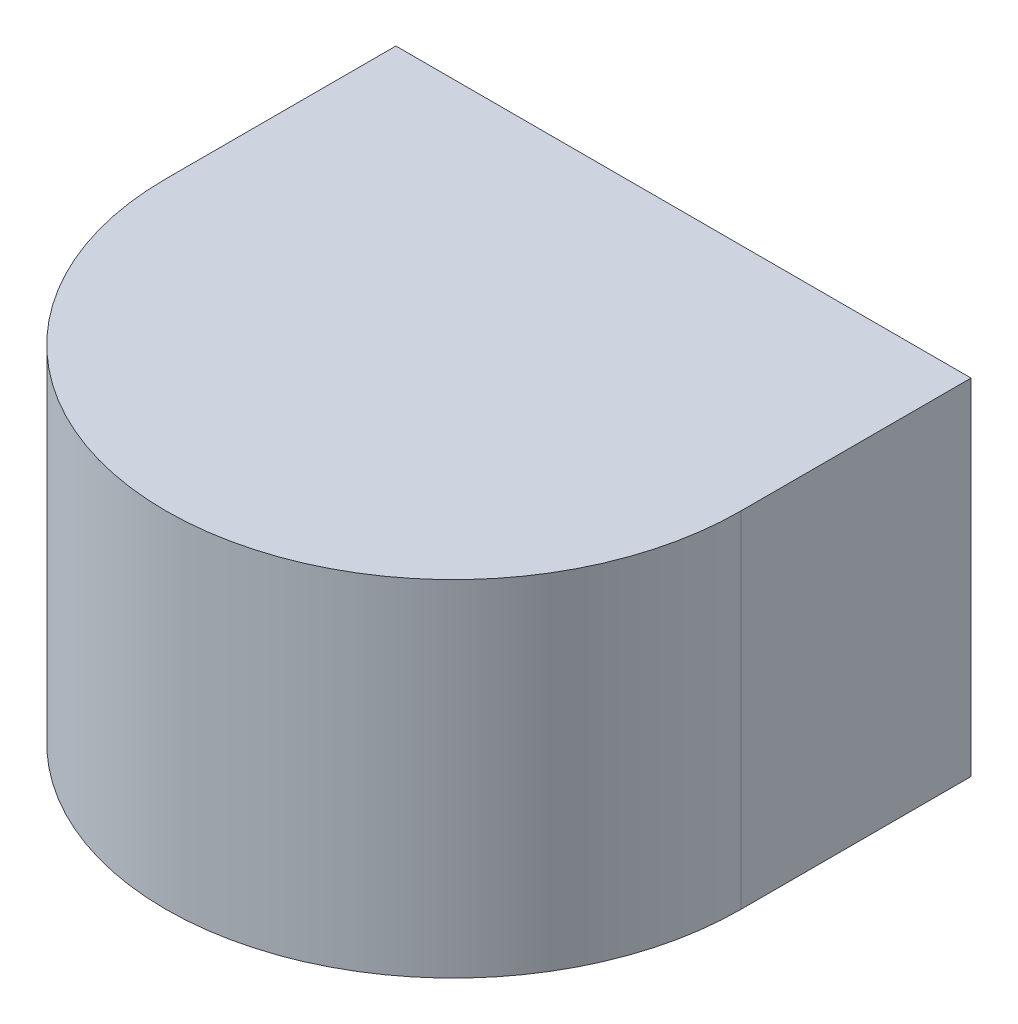
ISO-10303-21;
HEADER;
FILE_DESCRIPTION(('STEP AP214'),'2;1');
FILE_NAME('part.step','',(''),(''),'','','');
FILE_SCHEMA(('AUTOMOTIVE_DESIGN { 1 0 10303 214 1 1 1 1 }'));
ENDSEC;
DATA;
#1=APPLICATION_CONTEXT('core data for automotive mechanical design processes');
#2=APPLICATION_PROTOCOL_DEFINITION('international standard','automotive_design',2000,#1);
#3=PRODUCT_CONTEXT('',#1,'mechanical');
#4=PRODUCT('Part','Part','',(#3));
#5=PRODUCT_RELATED_PRODUCT_CATEGORY('part','',(#4));
#6=PRODUCT_DEFINITION_FORMATION('','',#4);
#7=PRODUCT_DEFINITION_CONTEXT('part definition',#1,'design');
#8=PRODUCT_DEFINITION('design','',#6,#7);
#9=PRODUCT_DEFINITION_SHAPE('','',#8);
#10=(LENGTH_UNIT() NAMED_UNIT(*) SI_UNIT(.MILLI.,.METRE.));
#11=(NAMED_UNIT(*) PLANE_ANGLE_UNIT() SI_UNIT($,.RADIAN.));
#12=(NAMED_UNIT(*) SI_UNIT($,.STERADIAN.) SOLID_ANGLE_UNIT());
#13=UNCERTAINTY_MEASURE_WITH_UNIT(LENGTH_MEASURE(1.E-05),#10,'distance_accuracy_value','');
#14=(GEOMETRIC_REPRESENTATION_CONTEXT(3) GLOBAL_UNCERTAINTY_ASSIGNED_CONTEXT((#13)) GLOBAL_UNIT_ASSIGNED_CONTEXT((#10,
#11,#12)) REPRESENTATION_CONTEXT('',''));
#15=CARTESIAN_POINT('',(0.,0.,0.));
#16=DIRECTION('',(0.,0.,1.));
#17=DIRECTION('',(1.,0.,0.));
#18=AXIS2_PLACEMENT_3D('',#15,#16,#17);
#19=CARTESIAN_POINT('',(0.,100.,0.));
#20=DIRECTION('',(0.,-1.,0.));
#21=DIRECTION('',(0.,0.,-1.));
#22=AXIS2_PLACEMENT_3D('',#19,#20,#21);
#23=CYLINDRICAL_SURFACE('',#22,125.);
#24=CARTESIAN_POINT('',(0.,0.,0.));
#25=DIRECTION('',(0.,1.,0.));
#26=DIRECTION('',(0.,0.,-1.));
#27=AXIS2_PLACEMENT_3D('',#24,#25,#26);
#28=CIRCLE('',#27,125.);
#29=CARTESIAN_POINT('',(-125.,0.,0.));
#30=VERTEX_POINT('',#29);
#31=CARTESIAN_POINT('',(125.,0.,0.));
#32=VERTEX_POINT('',#31);
#33=EDGE_CURVE('E230',#30,#32,#28,.T.);
#34=ORIENTED_EDGE('',*,*,#33,.T.);
#35=DIRECTION('',(0.,-1.,0.));
#36=VECTOR('',#35,1.);
#37=CARTESIAN_POINT('',(125.,100.,0.));
#38=LINE('',#37,#36);
#39=CARTESIAN_POINT('',(125.,150.,0.));
#40=VERTEX_POINT('',#39);
#41=EDGE_CURVE('E11',#40,#32,#38,.T.);
#42=ORIENTED_EDGE('',*,*,#41,.F.);
#43=CARTESIAN_POINT('',(0.,150.,0.));
#44=DIRECTION('',(0.,1.,0.));
#45=DIRECTION('',(0.,0.,1.));
#46=AXIS2_PLACEMENT_3D('',#43,#44,#45);
#47=CIRCLE('',#46,125.);
#48=CARTESIAN_POINT('',(-125.,150.,0.));
#49=VERTEX_POINT('',#48);
#50=EDGE_CURVE('E218',#49,#40,#47,.T.);
#51=ORIENTED_EDGE('',*,*,#50,.F.);
#52=DIRECTION('',(0.,-1.,0.));
#53=VECTOR('',#52,1.);
#54=CARTESIAN_POINT('',(-125.,100.,0.));
#55=LINE('',#54,#53);
#56=EDGE_CURVE('E247',#49,#30,#55,.T.);
#57=ORIENTED_EDGE('',*,*,#56,.T.);
#58=EDGE_LOOP('',(#34,#42,#51,#57));
#59=FACE_BOUND('',#58,.T.);
#60=ADVANCED_FACE('F35',(#59),#23,.T.);
#61=CARTESIAN_POINT('',(125.,100.,0.));
#62=DIRECTION('',(-1.,0.,0.));
#63=DIRECTION('',(0.,0.,1.));
#64=AXIS2_PLACEMENT_3D('',#61,#62,#63);
#65=PLANE('',#64);
#66=DIRECTION('',(0.,0.,-1.));
#67=VECTOR('',#66,1.);
#68=CARTESIAN_POINT('',(125.,0.,0.));
#69=LINE('',#68,#67);
#70=CARTESIAN_POINT('',(125.,0.,-100.));
#71=VERTEX_POINT('',#70);
#72=EDGE_CURVE('E293',#32,#71,#69,.T.);
#73=ORIENTED_EDGE('',*,*,#72,.T.);
#74=DIRECTION('',(0.,-1.,0.));
#75=VECTOR('',#74,1.);
#76=CARTESIAN_POINT('',(125.,100.,-100.));
#77=LINE('',#76,#75);
#78=CARTESIAN_POINT('',(125.,150.,-100.));
#79=VERTEX_POINT('',#78);
#80=EDGE_CURVE('E43',#79,#71,#77,.T.);
#81=ORIENTED_EDGE('',*,*,#80,.F.);
#82=DIRECTION('',(0.,0.,-1.));
#83=VECTOR('',#82,1.);
#84=CARTESIAN_POINT('',(125.,150.,0.));
#85=LINE('',#84,#83);
#86=EDGE_CURVE('E221',#40,#79,#85,.T.);
#87=ORIENTED_EDGE('',*,*,#86,.F.);
#88=ORIENTED_EDGE('',*,*,#41,.T.);
#89=EDGE_LOOP('',(#73,#81,#87,#88));
#90=FACE_BOUND('',#89,.T.);
#91=ADVANCED_FACE('F311',(#90),#65,.F.);
#92=CARTESIAN_POINT('',(100.,100.,-100.));
#93=DIRECTION('',(1.,0.,0.));
#94=DIRECTION('',(0.,0.,-1.));
#95=AXIS2_PLACEMENT_3D('',#92,#93,#94);
#96=PLANE('',#95);
#97=DIRECTION('',(0.,0.,1.));
#98=VECTOR('',#97,1.);
#99=CARTESIAN_POINT('',(100.,0.,-100.));
#100=LINE('',#99,#98);
#101=CARTESIAN_POINT('',(100.,0.,-100.));
#102=VERTEX_POINT('',#101);
#103=CARTESIAN_POINT('',(100.,0.,-70.));
#104=VERTEX_POINT('',#103);
#105=EDGE_CURVE('E297',#102,#104,#100,.T.);
#106=ORIENTED_EDGE('',*,*,#105,.T.);
#107=DIRECTION('',(0.,-1.,0.));
#108=VECTOR('',#107,1.);
#109=CARTESIAN_POINT('',(100.,100.,-70.));
#110=LINE('',#109,#108);
#111=CARTESIAN_POINT('',(100.,100.,-70.));
#112=VERTEX_POINT('',#111);
#113=EDGE_CURVE('E253',#112,#104,#110,.T.);
#114=ORIENTED_EDGE('',*,*,#113,.F.);
#115=DIRECTION('',(0.,0.,1.));
#116=VECTOR('',#115,1.);
#117=CARTESIAN_POINT('',(100.,100.,-100.));
#118=LINE('',#117,#116);
#119=CARTESIAN_POINT('',(100.,100.,-100.));
#120=VERTEX_POINT('',#119);
#121=EDGE_CURVE('E239',#120,#112,#118,.T.);
#122=ORIENTED_EDGE('',*,*,#121,.F.);
#123=DIRECTION('',(0.,-1.,0.));
#124=VECTOR('',#123,1.);
#125=CARTESIAN_POINT('',(100.,100.,-100.));
#126=LINE('',#125,#124);
#127=EDGE_CURVE('E250',#120,#102,#126,.T.);
#128=ORIENTED_EDGE('',*,*,#127,.T.);
#129=EDGE_LOOP('',(#106,#114,#122,#128));
#130=FACE_BOUND('',#129,.T.);
#131=ADVANCED_FACE('F308',(#130),#96,.F.);
#132=CARTESIAN_POINT('',(-100.,100.,-70.));
#133=DIRECTION('',(0.,0.,1.));
#134=DIRECTION('',(1.,0.,0.));
#135=AXIS2_PLACEMENT_3D('',#132,#133,#134);
#136=PLANE('',#135);
#137=DIRECTION('',(-1.,0.,0.));
#138=VECTOR('',#137,1.);
#139=CARTESIAN_POINT('',(-100.,0.,-70.));
#140=LINE('',#139,#138);
#141=CARTESIAN_POINT('',(-100.,0.,-70.));
#142=VERTEX_POINT('',#141);
#143=EDGE_CURVE('E301',#104,#142,#140,.T.);
#144=ORIENTED_EDGE('',*,*,#143,.T.);
#145=DIRECTION('',(0.,-1.,0.));
#146=VECTOR('',#145,1.);
#147=CARTESIAN_POINT('',(-100.,100.,-70.));
#148=LINE('',#147,#146);
#149=CARTESIAN_POINT('',(-100.,100.,-70.));
#150=VERTEX_POINT('',#149);
#151=EDGE_CURVE('E274',#150,#142,#148,.T.);
#152=ORIENTED_EDGE('',*,*,#151,.F.);
#153=DIRECTION('',(-1.,0.,0.));
#154=VECTOR('',#153,1.);
#155=CARTESIAN_POINT('',(-100.,100.,-70.));
#156=LINE('',#155,#154);
#157=EDGE_CURVE('E235',#112,#150,#156,.T.);
#158=ORIENTED_EDGE('',*,*,#157,.F.);
#159=ORIENTED_EDGE('',*,*,#113,.T.);
#160=EDGE_LOOP('',(#144,#152,#158,#159));
#161=FACE_BOUND('',#160,.T.);
#162=ADVANCED_FACE('F305',(#161),#136,.F.);
#163=CARTESIAN_POINT('',(-100.,100.,-100.));
#164=DIRECTION('',(-1.,0.,0.));
#165=DIRECTION('',(0.,0.,1.));
#166=AXIS2_PLACEMENT_3D('',#163,#164,#165);
#167=PLANE('',#166);
#168=DIRECTION('',(0.,0.,-1.));
#169=VECTOR('',#168,1.);
#170=CARTESIAN_POINT('',(-100.,0.,-100.));
#171=LINE('',#170,#169);
#172=CARTESIAN_POINT('',(-100.,0.,-100.));
#173=VERTEX_POINT('',#172);
#174=EDGE_CURVE('E266',#142,#173,#171,.T.);
#175=ORIENTED_EDGE('',*,*,#174,.T.);
#176=DIRECTION('',(0.,-1.,0.));
#177=VECTOR('',#176,1.);
#178=CARTESIAN_POINT('',(-100.,100.,-100.));
#179=LINE('',#178,#177);
#180=CARTESIAN_POINT('',(-100.,100.,-100.));
#181=VERTEX_POINT('',#180);
#182=EDGE_CURVE('E273',#181,#173,#179,.T.);
#183=ORIENTED_EDGE('',*,*,#182,.F.);
#184=DIRECTION('',(0.,0.,-1.));
#185=VECTOR('',#184,1.);
#186=CARTESIAN_POINT('',(-100.,100.,-100.));
#187=LINE('',#186,#185);
#188=EDGE_CURVE('E238',#150,#181,#187,.T.);
#189=ORIENTED_EDGE('',*,*,#188,.F.);
#190=ORIENTED_EDGE('',*,*,#151,.T.);
#191=EDGE_LOOP('',(#175,#183,#189,#190));
#192=FACE_BOUND('',#191,.T.);
#193=ADVANCED_FACE('F302',(#192),#167,.F.);
#194=CARTESIAN_POINT('',(-125.,100.,-100.));
#195=DIRECTION('',(0.,0.,1.));
#196=DIRECTION('',(1.,0.,0.));
#197=AXIS2_PLACEMENT_3D('',#194,#195,#196);
#198=PLANE('',#197);
#199=DIRECTION('',(-1.,0.,0.));
#200=VECTOR('',#199,1.);
#201=CARTESIAN_POINT('',(-125.,0.,-100.));
#202=LINE('',#201,#200);
#203=CARTESIAN_POINT('',(-125.,0.,-100.));
#204=VERTEX_POINT('',#203);
#205=EDGE_CURVE('E260',#173,#204,#202,.T.);
#206=ORIENTED_EDGE('',*,*,#205,.T.);
#207=DIRECTION('',(0.,-1.,0.));
#208=VECTOR('',#207,1.);
#209=CARTESIAN_POINT('',(-125.,100.,-100.));
#210=LINE('',#209,#208);
#211=CARTESIAN_POINT('',(-125.,150.,-100.));
#212=VERTEX_POINT('',#211);
#213=EDGE_CURVE('E271',#212,#204,#210,.T.);
#214=ORIENTED_EDGE('',*,*,#213,.F.);
#215=DIRECTION('',(-1.,0.,0.));
#216=VECTOR('',#215,1.);
#217=CARTESIAN_POINT('',(125.,150.,-100.));
#218=LINE('',#217,#216);
#219=EDGE_CURVE('E224',#79,#212,#218,.T.);
#220=ORIENTED_EDGE('',*,*,#219,.F.);
#221=ORIENTED_EDGE('',*,*,#80,.T.);
#222=DIRECTION('',(-1.,0.,0.));
#223=VECTOR('',#222,1.);
#224=CARTESIAN_POINT('',(125.,0.,-100.));
#225=LINE('',#224,#223);
#226=EDGE_CURVE('E295',#71,#102,#225,.T.);
#227=ORIENTED_EDGE('',*,*,#226,.T.);
#228=ORIENTED_EDGE('',*,*,#127,.F.);
#229=DIRECTION('',(-1.,0.,0.));
#230=VECTOR('',#229,1.);
#231=CARTESIAN_POINT('',(-100.,100.,-100.));
#232=LINE('',#231,#230);
#233=EDGE_CURVE('E212',#120,#181,#232,.T.);
#234=ORIENTED_EDGE('',*,*,#233,.T.);
#235=ORIENTED_EDGE('',*,*,#182,.T.);
#236=EDGE_LOOP('',(#206,#214,#220,#221,#227,#228,#234,#235));
#237=FACE_BOUND('',#236,.T.);
#238=ADVANCED_FACE('F283',(#237),#198,.F.);
#239=CARTESIAN_POINT('',(-125.,100.,0.));
#240=DIRECTION('',(1.,0.,0.));
#241=DIRECTION('',(0.,0.,-1.));
#242=AXIS2_PLACEMENT_3D('',#239,#240,#241);
#243=PLANE('',#242);
#244=DIRECTION('',(0.,0.,1.));
#245=VECTOR('',#244,1.);
#246=CARTESIAN_POINT('',(-125.,0.,0.));
#247=LINE('',#246,#245);
#248=EDGE_CURVE('E256',#204,#30,#247,.T.);
#249=ORIENTED_EDGE('',*,*,#248,.T.);
#250=ORIENTED_EDGE('',*,*,#56,.F.);
#251=DIRECTION('',(0.,0.,1.));
#252=VECTOR('',#251,1.);
#253=CARTESIAN_POINT('',(-125.,150.,-100.));
#254=LINE('',#253,#252);
#255=EDGE_CURVE('E227',#212,#49,#254,.T.);
#256=ORIENTED_EDGE('',*,*,#255,.F.);
#257=ORIENTED_EDGE('',*,*,#213,.T.);
#258=EDGE_LOOP('',(#249,#250,#256,#257));
#259=FACE_BOUND('',#258,.T.);
#260=ADVANCED_FACE('F316',(#259),#243,.F.);
#261=CARTESIAN_POINT('',(0.,0.,0.));
#262=DIRECTION('',(0.,-1.,0.));
#263=DIRECTION('',(0.,0.,-1.));
#264=AXIS2_PLACEMENT_3D('',#261,#262,#263);
#265=PLANE('',#264);
#266=DIRECTION('',(0.,0.,1.));
#267=VECTOR('',#266,1.);
#268=CARTESIAN_POINT('',(113.,0.,-22.5));
#269=LINE('',#268,#267);
#270=CARTESIAN_POINT('',(113.,0.,-22.5));
#271=VERTEX_POINT('',#270);
#272=CARTESIAN_POINT('',(113.,0.,22.5));
#273=VERTEX_POINT('',#272);
#274=EDGE_CURVE('E51',#271,#273,#269,.T.);
#275=ORIENTED_EDGE('',*,*,#274,.F.);
#276=DIRECTION('',(1.,0.,0.));
#277=VECTOR('',#276,1.);
#278=CARTESIAN_POINT('',(113.,0.,-22.5));
#279=LINE('',#278,#277);
#280=CARTESIAN_POINT('',(83.,0.,-22.5));
#281=VERTEX_POINT('',#280);
#282=EDGE_CURVE('E169',#281,#271,#279,.T.);
#283=ORIENTED_EDGE('',*,*,#282,.F.);
#284=DIRECTION('',(0.,0.,-1.));
#285=VECTOR('',#284,1.);
#286=CARTESIAN_POINT('',(83.,0.,-22.5));
#287=LINE('',#286,#285);
#288=CARTESIAN_POINT('',(83.,0.,22.5));
#289=VERTEX_POINT('',#288);
#290=EDGE_CURVE('E172',#289,#281,#287,.T.);
#291=ORIENTED_EDGE('',*,*,#290,.F.);
#292=DIRECTION('',(-1.,0.,0.));
#293=VECTOR('',#292,1.);
#294=CARTESIAN_POINT('',(113.,0.,22.5));
#295=LINE('',#294,#293);
#296=EDGE_CURVE('E178',#273,#289,#295,.T.);
#297=ORIENTED_EDGE('',*,*,#296,.F.);
#298=EDGE_LOOP('',(#275,#283,#291,#297));
#299=FACE_BOUND('',#298,.T.);
#300=DIRECTION('',(0.,0.,1.));
#301=VECTOR('',#300,1.);
#302=CARTESIAN_POINT('',(-83.,0.,-22.5));
#303=LINE('',#302,#301);
#304=CARTESIAN_POINT('',(-83.,0.,-22.5));
#305=VERTEX_POINT('',#304);
#306=CARTESIAN_POINT('',(-83.,0.,22.5));
#307=VERTEX_POINT('',#306);
#308=EDGE_CURVE('E59',#305,#307,#303,.T.);
#309=ORIENTED_EDGE('',*,*,#308,.F.);
#310=DIRECTION('',(1.,0.,0.));
#311=VECTOR('',#310,1.);
#312=CARTESIAN_POINT('',(-113.,0.,-22.5));
#313=LINE('',#312,#311);
#314=CARTESIAN_POINT('',(-113.,0.,-22.5));
#315=VERTEX_POINT('',#314);
#316=EDGE_CURVE('E191',#315,#305,#313,.T.);
#317=ORIENTED_EDGE('',*,*,#316,.F.);
#318=DIRECTION('',(0.,0.,-1.));
#319=VECTOR('',#318,1.);
#320=CARTESIAN_POINT('',(-113.,0.,-22.5));
#321=LINE('',#320,#319);
#322=CARTESIAN_POINT('',(-113.,0.,22.5));
#323=VERTEX_POINT('',#322);
#324=EDGE_CURVE('E205',#323,#315,#321,.T.);
#325=ORIENTED_EDGE('',*,*,#324,.F.);
#326=DIRECTION('',(-1.,0.,0.));
#327=VECTOR('',#326,1.);
#328=CARTESIAN_POINT('',(-113.,0.,22.5));
#329=LINE('',#328,#327);
#330=EDGE_CURVE('E202',#307,#323,#329,.T.);
#331=ORIENTED_EDGE('',*,*,#330,.F.);
#332=EDGE_LOOP('',(#309,#317,#325,#331));
#333=FACE_BOUND('',#332,.T.);
#334=ORIENTED_EDGE('',*,*,#33,.F.);
#335=ORIENTED_EDGE('',*,*,#248,.F.);
#336=ORIENTED_EDGE('',*,*,#205,.F.);
#337=ORIENTED_EDGE('',*,*,#174,.F.);
#338=ORIENTED_EDGE('',*,*,#143,.F.);
#339=ORIENTED_EDGE('',*,*,#105,.F.);
#340=ORIENTED_EDGE('',*,*,#226,.F.);
#341=ORIENTED_EDGE('',*,*,#72,.F.);
#342=EDGE_LOOP('',(#334,#335,#336,#337,#338,#339,#340,#341));
#343=FACE_BOUND('',#342,.T.);
#344=ADVANCED_FACE('F289',(#299,#333,#343),#265,.T.);
#345=CARTESIAN_POINT('',(0.,100.,0.));
#346=DIRECTION('',(0.,1.,0.));
#347=DIRECTION('',(0.,0.,1.));
#348=AXIS2_PLACEMENT_3D('',#345,#346,#347);
#349=PLANE('',#348);
#350=ORIENTED_EDGE('',*,*,#233,.F.);
#351=ORIENTED_EDGE('',*,*,#121,.T.);
#352=ORIENTED_EDGE('',*,*,#157,.T.);
#353=ORIENTED_EDGE('',*,*,#188,.T.);
#354=EDGE_LOOP('',(#350,#351,#352,#353));
#355=FACE_BOUND('',#354,.T.);
#356=ADVANCED_FACE('F324',(#355),#349,.F.);
#357=CARTESIAN_POINT('',(0.,150.,0.));
#358=DIRECTION('',(0.,1.,0.));
#359=DIRECTION('',(0.,0.,1.));
#360=AXIS2_PLACEMENT_3D('',#357,#358,#359);
#361=PLANE('',#360);
#362=ORIENTED_EDGE('',*,*,#50,.T.);
#363=ORIENTED_EDGE('',*,*,#86,.T.);
#364=ORIENTED_EDGE('',*,*,#219,.T.);
#365=ORIENTED_EDGE('',*,*,#255,.T.);
#366=EDGE_LOOP('',(#362,#363,#364,#365));
#367=FACE_BOUND('',#366,.T.);
#368=ADVANCED_FACE('F313',(#367),#361,.T.);
#369=CARTESIAN_POINT('',(-83.,20.,-22.5));
#370=DIRECTION('',(1.,0.,0.));
#371=DIRECTION('',(0.,0.,-1.));
#372=AXIS2_PLACEMENT_3D('',#369,#370,#371);
#373=PLANE('',#372);
#374=ORIENTED_EDGE('',*,*,#308,.T.);
#375=DIRECTION('',(0.,-1.,0.));
#376=VECTOR('',#375,1.);
#377=CARTESIAN_POINT('',(-83.,20.,22.5));
#378=LINE('',#377,#376);
#379=CARTESIAN_POINT('',(-83.,20.,22.5));
#380=VERTEX_POINT('',#379);
#381=EDGE_CURVE('E200',#380,#307,#378,.T.);
#382=ORIENTED_EDGE('',*,*,#381,.F.);
#383=DIRECTION('',(0.,0.,1.));
#384=VECTOR('',#383,1.);
#385=CARTESIAN_POINT('',(-83.,20.,-22.5));
#386=LINE('',#385,#384);
#387=CARTESIAN_POINT('',(-83.,20.,-22.5));
#388=VERTEX_POINT('',#387);
#389=EDGE_CURVE('E187',#388,#380,#386,.T.);
#390=ORIENTED_EDGE('',*,*,#389,.F.);
#391=DIRECTION('',(0.,-1.,0.));
#392=VECTOR('',#391,1.);
#393=CARTESIAN_POINT('',(-83.,20.,-22.5));
#394=LINE('',#393,#392);
#395=EDGE_CURVE('E210',#388,#305,#394,.T.);
#396=ORIENTED_EDGE('',*,*,#395,.T.);
#397=EDGE_LOOP('',(#374,#382,#390,#396));
#398=FACE_BOUND('',#397,.T.);
#399=ADVANCED_FACE('F370',(#398),#373,.F.);
#400=CARTESIAN_POINT('',(-113.,20.,-22.5));
#401=DIRECTION('',(0.,0.,-1.));
#402=DIRECTION('',(-1.,0.,0.));
#403=AXIS2_PLACEMENT_3D('',#400,#401,#402);
#404=PLANE('',#403);
#405=ORIENTED_EDGE('',*,*,#316,.T.);
#406=ORIENTED_EDGE('',*,*,#395,.F.);
#407=DIRECTION('',(1.,0.,0.));
#408=VECTOR('',#407,1.);
#409=CARTESIAN_POINT('',(-113.,20.,-22.5));
#410=LINE('',#409,#408);
#411=CARTESIAN_POINT('',(-113.,20.,-22.5));
#412=VERTEX_POINT('',#411);
#413=EDGE_CURVE('E197',#412,#388,#410,.T.);
#414=ORIENTED_EDGE('',*,*,#413,.F.);
#415=DIRECTION('',(0.,-1.,0.));
#416=VECTOR('',#415,1.);
#417=CARTESIAN_POINT('',(-113.,20.,-22.5));
#418=LINE('',#417,#416);
#419=EDGE_CURVE('E213',#412,#315,#418,.T.);
#420=ORIENTED_EDGE('',*,*,#419,.T.);
#421=EDGE_LOOP('',(#405,#406,#414,#420));
#422=FACE_BOUND('',#421,.T.);
#423=ADVANCED_FACE('F383',(#422),#404,.F.);
#424=CARTESIAN_POINT('',(-113.,20.,-22.5));
#425=DIRECTION('',(-1.,0.,0.));
#426=DIRECTION('',(0.,0.,1.));
#427=AXIS2_PLACEMENT_3D('',#424,#425,#426);
#428=PLANE('',#427);
#429=ORIENTED_EDGE('',*,*,#324,.T.);
#430=ORIENTED_EDGE('',*,*,#419,.F.);
#431=DIRECTION('',(0.,0.,-1.));
#432=VECTOR('',#431,1.);
#433=CARTESIAN_POINT('',(-113.,20.,-22.5));
#434=LINE('',#433,#432);
#435=CARTESIAN_POINT('',(-113.,20.,22.5));
#436=VERTEX_POINT('',#435);
#437=EDGE_CURVE('E194',#436,#412,#434,.T.);
#438=ORIENTED_EDGE('',*,*,#437,.F.);
#439=DIRECTION('',(0.,-1.,0.));
#440=VECTOR('',#439,1.);
#441=CARTESIAN_POINT('',(-113.,20.,22.5));
#442=LINE('',#441,#440);
#443=EDGE_CURVE('E215',#436,#323,#442,.T.);
#444=ORIENTED_EDGE('',*,*,#443,.T.);
#445=EDGE_LOOP('',(#429,#430,#438,#444));
#446=FACE_BOUND('',#445,.T.);
#447=ADVANCED_FACE('F392',(#446),#428,.F.);
#448=CARTESIAN_POINT('',(-113.,20.,22.5));
#449=DIRECTION('',(0.,0.,1.));
#450=DIRECTION('',(1.,0.,0.));
#451=AXIS2_PLACEMENT_3D('',#448,#449,#450);
#452=PLANE('',#451);
#453=ORIENTED_EDGE('',*,*,#330,.T.);
#454=ORIENTED_EDGE('',*,*,#443,.F.);
#455=DIRECTION('',(-1.,0.,0.));
#456=VECTOR('',#455,1.);
#457=CARTESIAN_POINT('',(-113.,20.,22.5));
#458=LINE('',#457,#456);
#459=EDGE_CURVE('E190',#380,#436,#458,.T.);
#460=ORIENTED_EDGE('',*,*,#459,.F.);
#461=ORIENTED_EDGE('',*,*,#381,.T.);
#462=EDGE_LOOP('',(#453,#454,#460,#461));
#463=FACE_BOUND('',#462,.T.);
#464=ADVANCED_FACE('F402',(#463),#452,.F.);
#465=CARTESIAN_POINT('',(0.,20.,0.));
#466=DIRECTION('',(0.,1.,0.));
#467=DIRECTION('',(0.,0.,1.));
#468=AXIS2_PLACEMENT_3D('',#465,#466,#467);
#469=PLANE('',#468);
#470=ORIENTED_EDGE('',*,*,#389,.T.);
#471=ORIENTED_EDGE('',*,*,#459,.T.);
#472=ORIENTED_EDGE('',*,*,#437,.T.);
#473=ORIENTED_EDGE('',*,*,#413,.T.);
#474=EDGE_LOOP('',(#470,#471,#472,#473));
#475=FACE_BOUND('',#474,.T.);
#476=ADVANCED_FACE('F412',(#475),#469,.F.);
#477=CARTESIAN_POINT('',(113.,20.,-22.5));
#478=DIRECTION('',(1.,0.,0.));
#479=DIRECTION('',(0.,0.,-1.));
#480=AXIS2_PLACEMENT_3D('',#477,#478,#479);
#481=PLANE('',#480);
#482=ORIENTED_EDGE('',*,*,#274,.T.);
#483=DIRECTION('',(0.,-1.,0.));
#484=VECTOR('',#483,1.);
#485=CARTESIAN_POINT('',(113.,20.,22.5));
#486=LINE('',#485,#484);
#487=CARTESIAN_POINT('',(113.,20.,22.5));
#488=VERTEX_POINT('',#487);
#489=EDGE_CURVE('E147',#488,#273,#486,.T.);
#490=ORIENTED_EDGE('',*,*,#489,.F.);
#491=DIRECTION('',(0.,0.,1.));
#492=VECTOR('',#491,1.);
#493=CARTESIAN_POINT('',(113.,20.,-22.5));
#494=LINE('',#493,#492);
#495=CARTESIAN_POINT('',(113.,20.,-22.5));
#496=VERTEX_POINT('',#495);
#497=EDGE_CURVE('E151',#496,#488,#494,.T.);
#498=ORIENTED_EDGE('',*,*,#497,.F.);
#499=DIRECTION('',(0.,-1.,0.));
#500=VECTOR('',#499,1.);
#501=CARTESIAN_POINT('',(113.,20.,-22.5));
#502=LINE('',#501,#500);
#503=EDGE_CURVE('E182',#496,#271,#502,.T.);
#504=ORIENTED_EDGE('',*,*,#503,.T.);
#505=EDGE_LOOP('',(#482,#490,#498,#504));
#506=FACE_BOUND('',#505,.T.);
#507=ADVANCED_FACE('F149',(#506),#481,.F.);
#508=CARTESIAN_POINT('',(113.,20.,-22.5));
#509=DIRECTION('',(0.,0.,-1.));
#510=DIRECTION('',(-1.,0.,0.));
#511=AXIS2_PLACEMENT_3D('',#508,#509,#510);
#512=PLANE('',#511);
#513=ORIENTED_EDGE('',*,*,#282,.T.);
#514=ORIENTED_EDGE('',*,*,#503,.F.);
#515=DIRECTION('',(1.,0.,0.));
#516=VECTOR('',#515,1.);
#517=CARTESIAN_POINT('',(113.,20.,-22.5));
#518=LINE('',#517,#516);
#519=CARTESIAN_POINT('',(83.,20.,-22.5));
#520=VERTEX_POINT('',#519);
#521=EDGE_CURVE('E157',#520,#496,#518,.T.);
#522=ORIENTED_EDGE('',*,*,#521,.F.);
#523=DIRECTION('',(0.,-1.,0.));
#524=VECTOR('',#523,1.);
#525=CARTESIAN_POINT('',(83.,20.,-22.5));
#526=LINE('',#525,#524);
#527=EDGE_CURVE('E184',#520,#281,#526,.T.);
#528=ORIENTED_EDGE('',*,*,#527,.T.);
#529=EDGE_LOOP('',(#513,#514,#522,#528));
#530=FACE_BOUND('',#529,.T.);
#531=ADVANCED_FACE('F431',(#530),#512,.F.);
#532=CARTESIAN_POINT('',(83.,20.,-22.5));
#533=DIRECTION('',(-1.,0.,0.));
#534=DIRECTION('',(0.,0.,1.));
#535=AXIS2_PLACEMENT_3D('',#532,#533,#534);
#536=PLANE('',#535);
#537=ORIENTED_EDGE('',*,*,#290,.T.);
#538=ORIENTED_EDGE('',*,*,#527,.F.);
#539=DIRECTION('',(0.,0.,-1.));
#540=VECTOR('',#539,1.);
#541=CARTESIAN_POINT('',(83.,20.,-22.5));
#542=LINE('',#541,#540);
#543=CARTESIAN_POINT('',(83.,20.,22.5));
#544=VERTEX_POINT('',#543);
#545=EDGE_CURVE('E165',#544,#520,#542,.T.);
#546=ORIENTED_EDGE('',*,*,#545,.F.);
#547=DIRECTION('',(0.,-1.,0.));
#548=VECTOR('',#547,1.);
#549=CARTESIAN_POINT('',(83.,20.,22.5));
#550=LINE('',#549,#548);
#551=EDGE_CURVE('E156',#544,#289,#550,.T.);
#552=ORIENTED_EDGE('',*,*,#551,.T.);
#553=EDGE_LOOP('',(#537,#538,#546,#552));
#554=FACE_BOUND('',#553,.T.);
#555=ADVANCED_FACE('F440',(#554),#536,.F.);
#556=CARTESIAN_POINT('',(113.,20.,22.5));
#557=DIRECTION('',(0.,0.,1.));
#558=DIRECTION('',(1.,0.,0.));
#559=AXIS2_PLACEMENT_3D('',#556,#557,#558);
#560=PLANE('',#559);
#561=ORIENTED_EDGE('',*,*,#296,.T.);
#562=ORIENTED_EDGE('',*,*,#551,.F.);
#563=DIRECTION('',(-1.,0.,0.));
#564=VECTOR('',#563,1.);
#565=CARTESIAN_POINT('',(113.,20.,22.5));
#566=LINE('',#565,#564);
#567=EDGE_CURVE('E160',#488,#544,#566,.T.);
#568=ORIENTED_EDGE('',*,*,#567,.F.);
#569=ORIENTED_EDGE('',*,*,#489,.T.);
#570=EDGE_LOOP('',(#561,#562,#568,#569));
#571=FACE_BOUND('',#570,.T.);
#572=ADVANCED_FACE('F161',(#571),#560,.F.);
#573=CARTESIAN_POINT('',(0.,20.,0.));
#574=DIRECTION('',(0.,-1.,0.));
#575=DIRECTION('',(0.,0.,-1.));
#576=AXIS2_PLACEMENT_3D('',#573,#574,#575);
#577=PLANE('',#576);
#578=ORIENTED_EDGE('',*,*,#497,.T.);
#579=ORIENTED_EDGE('',*,*,#567,.T.);
#580=ORIENTED_EDGE('',*,*,#545,.T.);
#581=ORIENTED_EDGE('',*,*,#521,.T.);
#582=EDGE_LOOP('',(#578,#579,#580,#581));
#583=FACE_BOUND('',#582,.T.);
#584=ADVANCED_FACE('F167',(#583),#577,.T.);
#585=CLOSED_SHELL('',(#60,#91,#131,#162,#193,#238,#260,#344,#356,#368,#399,#423,#447,#464,#476,
#507,#531,#555,#572,#584));
#586=MANIFOLD_SOLID_BREP('B2',#585);
#587=ADVANCED_BREP_SHAPE_REPRESENTATION('',(#18,#586),#14);
#588=SHAPE_DEFINITION_REPRESENTATION(#9,#587);
ENDSEC;
END-ISO-10303-21;
